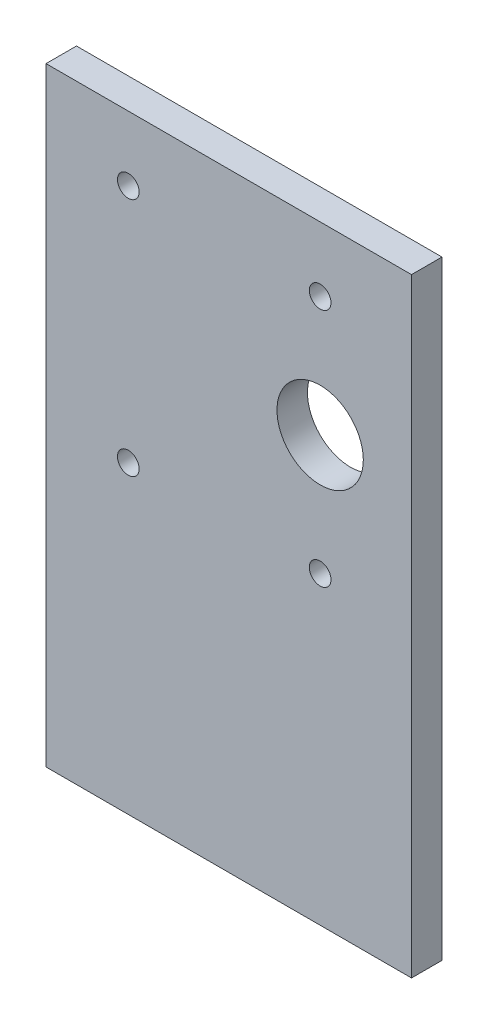
ISO-10303-21;
HEADER;
FILE_DESCRIPTION(('STEP AP214'),'2;1');
FILE_NAME('part.step','',(''),(''),'','','');
FILE_SCHEMA(('AUTOMOTIVE_DESIGN { 1 0 10303 214 1 1 1 1 }'));
ENDSEC;
DATA;
#1=APPLICATION_CONTEXT('core data for automotive mechanical design processes');
#2=APPLICATION_PROTOCOL_DEFINITION('international standard','automotive_design',2000,#1);
#3=PRODUCT_CONTEXT('',#1,'mechanical');
#4=PRODUCT('Part','Part','',(#3));
#5=PRODUCT_RELATED_PRODUCT_CATEGORY('part','',(#4));
#6=PRODUCT_DEFINITION_FORMATION('','',#4);
#7=PRODUCT_DEFINITION_CONTEXT('part definition',#1,'design');
#8=PRODUCT_DEFINITION('design','',#6,#7);
#9=PRODUCT_DEFINITION_SHAPE('','',#8);
#10=(LENGTH_UNIT() NAMED_UNIT(*) SI_UNIT(.MILLI.,.METRE.));
#11=(NAMED_UNIT(*) PLANE_ANGLE_UNIT() SI_UNIT($,.RADIAN.));
#12=(NAMED_UNIT(*) SI_UNIT($,.STERADIAN.) SOLID_ANGLE_UNIT());
#13=UNCERTAINTY_MEASURE_WITH_UNIT(LENGTH_MEASURE(1.E-05),#10,'distance_accuracy_value','');
#14=(GEOMETRIC_REPRESENTATION_CONTEXT(3) GLOBAL_UNCERTAINTY_ASSIGNED_CONTEXT((#13)) GLOBAL_UNIT_ASSIGNED_CONTEXT((#10,
#11,#12)) REPRESENTATION_CONTEXT('',''));
#15=CARTESIAN_POINT('',(0.,0.,0.));
#16=DIRECTION('',(0.,0.,1.));
#17=DIRECTION('',(1.,0.,0.));
#18=AXIS2_PLACEMENT_3D('',#15,#16,#17);
#19=CARTESIAN_POINT('',(-17.6716141001855,16.0811688311688,3.175));
#20=DIRECTION('',(1.,0.,0.));
#21=DIRECTION('',(0.,1.,0.));
#22=AXIS2_PLACEMENT_3D('',#19,#20,#21);
#23=PLANE('',#22);
#24=DIRECTION('',(0.,-1.,0.));
#25=VECTOR('',#24,1.);
#26=CARTESIAN_POINT('',(-17.6716141001855,16.0811688311688,0.));
#27=LINE('',#26,#25);
#28=CARTESIAN_POINT('',(-17.6716141001855,16.0811688311688,0.));
#29=VERTEX_POINT('',#28);
#30=CARTESIAN_POINT('',(-17.6716141001855,-47.4188311688312,0.));
#31=VERTEX_POINT('',#30);
#32=EDGE_CURVE('E100',#29,#31,#27,.T.);
#33=ORIENTED_EDGE('',*,*,#32,.T.);
#34=DIRECTION('',(0.,0.,-1.));
#35=VECTOR('',#34,1.);
#36=CARTESIAN_POINT('',(-17.6716141001855,-47.4188311688312,3.175));
#37=LINE('',#36,#35);
#38=CARTESIAN_POINT('',(-17.6716141001855,-47.4188311688312,3.175));
#39=VERTEX_POINT('',#38);
#40=EDGE_CURVE('E11',#39,#31,#37,.T.);
#41=ORIENTED_EDGE('',*,*,#40,.F.);
#42=DIRECTION('',(0.,-1.,0.));
#43=VECTOR('',#42,1.);
#44=CARTESIAN_POINT('',(-17.6716141001855,16.0811688311688,3.175));
#45=LINE('',#44,#43);
#46=CARTESIAN_POINT('',(-17.6716141001855,16.0811688311688,3.175));
#47=VERTEX_POINT('',#46);
#48=EDGE_CURVE('E88',#47,#39,#45,.T.);
#49=ORIENTED_EDGE('',*,*,#48,.F.);
#50=DIRECTION('',(0.,0.,-1.));
#51=VECTOR('',#50,1.);
#52=CARTESIAN_POINT('',(-17.6716141001855,16.0811688311688,3.175));
#53=LINE('',#52,#51);
#54=EDGE_CURVE('E96',#47,#29,#53,.T.);
#55=ORIENTED_EDGE('',*,*,#54,.T.);
#56=EDGE_LOOP('',(#33,#41,#49,#55));
#57=FACE_BOUND('',#56,.T.);
#58=ADVANCED_FACE('F37',(#57),#23,.F.);
#59=CARTESIAN_POINT('',(-17.6716141001855,-47.4188311688312,3.175));
#60=DIRECTION('',(0.,1.,0.));
#61=DIRECTION('',(0.,0.,1.));
#62=AXIS2_PLACEMENT_3D('',#59,#60,#61);
#63=PLANE('',#62);
#64=DIRECTION('',(1.,0.,0.));
#65=VECTOR('',#64,1.);
#66=CARTESIAN_POINT('',(-17.6716141001855,-47.4188311688312,0.));
#67=LINE('',#66,#65);
#68=CARTESIAN_POINT('',(20.4283858998145,-47.4188311688312,0.));
#69=VERTEX_POINT('',#68);
#70=EDGE_CURVE('E92',#31,#69,#67,.T.);
#71=ORIENTED_EDGE('',*,*,#70,.T.);
#72=DIRECTION('',(0.,0.,-1.));
#73=VECTOR('',#72,1.);
#74=CARTESIAN_POINT('',(20.4283858998145,-47.4188311688312,3.175));
#75=LINE('',#74,#73);
#76=CARTESIAN_POINT('',(20.4283858998145,-47.4188311688312,3.175));
#77=VERTEX_POINT('',#76);
#78=EDGE_CURVE('E45',#77,#69,#75,.T.);
#79=ORIENTED_EDGE('',*,*,#78,.F.);
#80=DIRECTION('',(1.,0.,0.));
#81=VECTOR('',#80,1.);
#82=CARTESIAN_POINT('',(-17.6716141001855,-47.4188311688312,3.175));
#83=LINE('',#82,#81);
#84=EDGE_CURVE('E83',#39,#77,#83,.T.);
#85=ORIENTED_EDGE('',*,*,#84,.F.);
#86=ORIENTED_EDGE('',*,*,#40,.T.);
#87=EDGE_LOOP('',(#71,#79,#85,#86));
#88=FACE_BOUND('',#87,.T.);
#89=ADVANCED_FACE('F91',(#88),#63,.F.);
#90=CARTESIAN_POINT('',(20.4283858998145,16.0811688311688,3.175));
#91=DIRECTION('',(-1.,0.,0.));
#92=DIRECTION('',(0.,-1.,0.));
#93=AXIS2_PLACEMENT_3D('',#90,#91,#92);
#94=PLANE('',#93);
#95=DIRECTION('',(0.,1.,0.));
#96=VECTOR('',#95,1.);
#97=CARTESIAN_POINT('',(20.4283858998145,16.0811688311688,0.));
#98=LINE('',#97,#96);
#99=CARTESIAN_POINT('',(20.4283858998145,16.0811688311688,0.));
#100=VERTEX_POINT('',#99);
#101=EDGE_CURVE('E70',#69,#100,#98,.T.);
#102=ORIENTED_EDGE('',*,*,#101,.T.);
#103=DIRECTION('',(0.,0.,-1.));
#104=VECTOR('',#103,1.);
#105=CARTESIAN_POINT('',(20.4283858998145,16.0811688311688,3.175));
#106=LINE('',#105,#104);
#107=CARTESIAN_POINT('',(20.4283858998145,16.0811688311688,3.175));
#108=VERTEX_POINT('',#107);
#109=EDGE_CURVE('E93',#108,#100,#106,.T.);
#110=ORIENTED_EDGE('',*,*,#109,.F.);
#111=DIRECTION('',(0.,1.,0.));
#112=VECTOR('',#111,1.);
#113=CARTESIAN_POINT('',(20.4283858998145,16.0811688311688,3.175));
#114=LINE('',#113,#112);
#115=EDGE_CURVE('E86',#77,#108,#114,.T.);
#116=ORIENTED_EDGE('',*,*,#115,.F.);
#117=ORIENTED_EDGE('',*,*,#78,.T.);
#118=EDGE_LOOP('',(#102,#110,#116,#117));
#119=FACE_BOUND('',#118,.T.);
#120=ADVANCED_FACE('F94',(#119),#94,.F.);
#121=CARTESIAN_POINT('',(-17.6716141001855,16.0811688311688,3.175));
#122=DIRECTION('',(0.,-1.,0.));
#123=DIRECTION('',(0.,0.,-1.));
#124=AXIS2_PLACEMENT_3D('',#121,#122,#123);
#125=PLANE('',#124);
#126=DIRECTION('',(-1.,0.,0.));
#127=VECTOR('',#126,1.);
#128=CARTESIAN_POINT('',(-17.6716141001855,16.0811688311688,0.));
#129=LINE('',#128,#127);
#130=EDGE_CURVE('E76',#100,#29,#129,.T.);
#131=ORIENTED_EDGE('',*,*,#130,.T.);
#132=ORIENTED_EDGE('',*,*,#54,.F.);
#133=DIRECTION('',(-1.,0.,0.));
#134=VECTOR('',#133,1.);
#135=CARTESIAN_POINT('',(-17.6716141001855,16.0811688311688,3.175));
#136=LINE('',#135,#134);
#137=EDGE_CURVE('E53',#108,#47,#136,.T.);
#138=ORIENTED_EDGE('',*,*,#137,.F.);
#139=ORIENTED_EDGE('',*,*,#109,.T.);
#140=EDGE_LOOP('',(#131,#132,#138,#139));
#141=FACE_BOUND('',#140,.T.);
#142=ADVANCED_FACE('F108',(#141),#125,.F.);
#143=CARTESIAN_POINT('',(0.,0.,3.175));
#144=DIRECTION('',(0.,0.,1.));
#145=DIRECTION('',(1.,0.,0.));
#146=AXIS2_PLACEMENT_3D('',#143,#144,#145);
#147=PLANE('',#146);
#148=CARTESIAN_POINT('',(10.9033858998145,-3.16395549842647,3.175));
#149=DIRECTION('',(0.,0.,1.));
#150=DIRECTION('',(1.,0.,0.));
#151=AXIS2_PLACEMENT_3D('',#148,#149,#150);
#152=CIRCLE('',#151,4.5);
#153=CARTESIAN_POINT('',(15.4033858998145,-3.16395549842647,3.175));
#154=VERTEX_POINT('',#153);
#155=EDGE_CURVE('E138',#154,#154,#152,.T.);
#156=ORIENTED_EDGE('',*,*,#155,.F.);
#157=EDGE_LOOP('',(#156));
#158=FACE_BOUND('',#157,.T.);
#159=CARTESIAN_POINT('',(10.9033858998145,9.33604450157353,3.175));
#160=DIRECTION('',(0.,0.,1.));
#161=DIRECTION('',(1.,0.,0.));
#162=AXIS2_PLACEMENT_3D('',#159,#160,#161);
#163=CIRCLE('',#162,1.13029999999999);
#164=CARTESIAN_POINT('',(12.0336858998145,9.33604450157353,3.175));
#165=VERTEX_POINT('',#164);
#166=EDGE_CURVE('E134',#165,#165,#163,.T.);
#167=ORIENTED_EDGE('',*,*,#166,.F.);
#168=EDGE_LOOP('',(#167));
#169=FACE_BOUND('',#168,.T.);
#170=CARTESIAN_POINT('',(10.9033858998145,-15.6639554984265,3.175));
#171=DIRECTION('',(0.,0.,1.));
#172=DIRECTION('',(1.,0.,0.));
#173=AXIS2_PLACEMENT_3D('',#170,#171,#172);
#174=CIRCLE('',#173,1.13029999999999);
#175=CARTESIAN_POINT('',(12.0336858998145,-15.6639554984265,3.175));
#176=VERTEX_POINT('',#175);
#177=EDGE_CURVE('E128',#176,#176,#174,.T.);
#178=ORIENTED_EDGE('',*,*,#177,.F.);
#179=EDGE_LOOP('',(#178));
#180=FACE_BOUND('',#179,.T.);
#181=CARTESIAN_POINT('',(-9.09661410018551,-15.6639554984265,3.175));
#182=DIRECTION('',(0.,0.,1.));
#183=DIRECTION('',(1.,0.,0.));
#184=AXIS2_PLACEMENT_3D('',#181,#182,#183);
#185=CIRCLE('',#184,1.13029999999999);
#186=CARTESIAN_POINT('',(-7.96631410018553,-15.6639554984265,3.175));
#187=VERTEX_POINT('',#186);
#188=EDGE_CURVE('E122',#187,#187,#185,.T.);
#189=ORIENTED_EDGE('',*,*,#188,.F.);
#190=EDGE_LOOP('',(#189));
#191=FACE_BOUND('',#190,.T.);
#192=CARTESIAN_POINT('',(-9.09661410018552,9.33604450157353,3.175));
#193=DIRECTION('',(0.,0.,1.));
#194=DIRECTION('',(1.,0.,0.));
#195=AXIS2_PLACEMENT_3D('',#192,#193,#194);
#196=CIRCLE('',#195,1.13029999999999);
#197=CARTESIAN_POINT('',(-7.96631410018553,9.33604450157353,3.175));
#198=VERTEX_POINT('',#197);
#199=EDGE_CURVE('E116',#198,#198,#196,.T.);
#200=ORIENTED_EDGE('',*,*,#199,.F.);
#201=EDGE_LOOP('',(#200));
#202=FACE_BOUND('',#201,.T.);
#203=ORIENTED_EDGE('',*,*,#48,.T.);
#204=ORIENTED_EDGE('',*,*,#84,.T.);
#205=ORIENTED_EDGE('',*,*,#115,.T.);
#206=ORIENTED_EDGE('',*,*,#137,.T.);
#207=EDGE_LOOP('',(#203,#204,#205,#206));
#208=FACE_BOUND('',#207,.T.);
#209=ADVANCED_FACE('F84',(#158,#169,#180,#191,#202,#208),#147,.T.);
#210=CARTESIAN_POINT('',(0.,0.,0.));
#211=DIRECTION('',(0.,0.,1.));
#212=DIRECTION('',(1.,0.,0.));
#213=AXIS2_PLACEMENT_3D('',#210,#211,#212);
#214=PLANE('',#213);
#215=CARTESIAN_POINT('',(10.9033858998145,-3.16395549842647,0.));
#216=DIRECTION('',(0.,0.,1.));
#217=DIRECTION('',(1.,0.,0.));
#218=AXIS2_PLACEMENT_3D('',#215,#216,#217);
#219=CIRCLE('',#218,4.5);
#220=CARTESIAN_POINT('',(15.4033858998145,-3.16395549842647,0.));
#221=VERTEX_POINT('',#220);
#222=EDGE_CURVE('E137',#221,#221,#219,.T.);
#223=ORIENTED_EDGE('',*,*,#222,.T.);
#224=EDGE_LOOP('',(#223));
#225=FACE_BOUND('',#224,.T.);
#226=CARTESIAN_POINT('',(10.9033858998145,9.33604450157353,0.));
#227=DIRECTION('',(0.,0.,1.));
#228=DIRECTION('',(1.,0.,0.));
#229=AXIS2_PLACEMENT_3D('',#226,#227,#228);
#230=CIRCLE('',#229,1.1303);
#231=CARTESIAN_POINT('',(12.0336858998145,9.33604450157353,0.));
#232=VERTEX_POINT('',#231);
#233=EDGE_CURVE('E131',#232,#232,#230,.T.);
#234=ORIENTED_EDGE('',*,*,#233,.T.);
#235=EDGE_LOOP('',(#234));
#236=FACE_BOUND('',#235,.T.);
#237=CARTESIAN_POINT('',(10.9033858998145,-15.6639554984265,0.));
#238=DIRECTION('',(0.,0.,1.));
#239=DIRECTION('',(1.,0.,0.));
#240=AXIS2_PLACEMENT_3D('',#237,#238,#239);
#241=CIRCLE('',#240,1.1303);
#242=CARTESIAN_POINT('',(12.0336858998145,-15.6639554984265,0.));
#243=VERTEX_POINT('',#242);
#244=EDGE_CURVE('E125',#243,#243,#241,.T.);
#245=ORIENTED_EDGE('',*,*,#244,.T.);
#246=EDGE_LOOP('',(#245));
#247=FACE_BOUND('',#246,.T.);
#248=CARTESIAN_POINT('',(-9.09661410018551,-15.6639554984265,0.));
#249=DIRECTION('',(0.,0.,1.));
#250=DIRECTION('',(1.,0.,0.));
#251=AXIS2_PLACEMENT_3D('',#248,#249,#250);
#252=CIRCLE('',#251,1.1303);
#253=CARTESIAN_POINT('',(-7.96631410018551,-15.6639554984265,0.));
#254=VERTEX_POINT('',#253);
#255=EDGE_CURVE('E119',#254,#254,#252,.T.);
#256=ORIENTED_EDGE('',*,*,#255,.T.);
#257=EDGE_LOOP('',(#256));
#258=FACE_BOUND('',#257,.T.);
#259=CARTESIAN_POINT('',(-9.09661410018552,9.33604450157353,0.));
#260=DIRECTION('',(0.,0.,1.));
#261=DIRECTION('',(1.,0.,0.));
#262=AXIS2_PLACEMENT_3D('',#259,#260,#261);
#263=CIRCLE('',#262,1.1303);
#264=CARTESIAN_POINT('',(-7.96631410018552,9.33604450157353,0.));
#265=VERTEX_POINT('',#264);
#266=EDGE_CURVE('E103',#265,#265,#263,.T.);
#267=ORIENTED_EDGE('',*,*,#266,.T.);
#268=EDGE_LOOP('',(#267));
#269=FACE_BOUND('',#268,.T.);
#270=ORIENTED_EDGE('',*,*,#32,.F.);
#271=ORIENTED_EDGE('',*,*,#130,.F.);
#272=ORIENTED_EDGE('',*,*,#101,.F.);
#273=ORIENTED_EDGE('',*,*,#70,.F.);
#274=EDGE_LOOP('',(#270,#271,#272,#273));
#275=FACE_BOUND('',#274,.T.);
#276=ADVANCED_FACE('F111',(#225,#236,#247,#258,#269,#275),#214,.F.);
#277=CARTESIAN_POINT('',(-9.09661410018552,9.33604450157353,3.175));
#278=DIRECTION('',(0.,0.,1.));
#279=DIRECTION('',(1.,0.,0.));
#280=AXIS2_PLACEMENT_3D('',#277,#278,#279);
#281=CYLINDRICAL_SURFACE('',#280,1.13029999999999);
#282=ORIENTED_EDGE('',*,*,#266,.F.);
#283=EDGE_LOOP('',(#282));
#284=FACE_BOUND('',#283,.T.);
#285=ORIENTED_EDGE('',*,*,#199,.T.);
#286=EDGE_LOOP('',(#285));
#287=FACE_BOUND('',#286,.T.);
#288=ADVANCED_FACE('F164',(#284,#287),#281,.F.);
#289=CARTESIAN_POINT('',(-9.09661410018551,-15.6639554984265,3.175));
#290=DIRECTION('',(0.,0.,1.));
#291=DIRECTION('',(1.,0.,0.));
#292=AXIS2_PLACEMENT_3D('',#289,#290,#291);
#293=CYLINDRICAL_SURFACE('',#292,1.13029999999999);
#294=ORIENTED_EDGE('',*,*,#255,.F.);
#295=EDGE_LOOP('',(#294));
#296=FACE_BOUND('',#295,.T.);
#297=ORIENTED_EDGE('',*,*,#188,.T.);
#298=EDGE_LOOP('',(#297));
#299=FACE_BOUND('',#298,.T.);
#300=ADVANCED_FACE('F166',(#296,#299),#293,.F.);
#301=CARTESIAN_POINT('',(10.9033858998145,-15.6639554984265,3.175));
#302=DIRECTION('',(0.,0.,1.));
#303=DIRECTION('',(1.,0.,0.));
#304=AXIS2_PLACEMENT_3D('',#301,#302,#303);
#305=CYLINDRICAL_SURFACE('',#304,1.13029999999999);
#306=ORIENTED_EDGE('',*,*,#244,.F.);
#307=EDGE_LOOP('',(#306));
#308=FACE_BOUND('',#307,.T.);
#309=ORIENTED_EDGE('',*,*,#177,.T.);
#310=EDGE_LOOP('',(#309));
#311=FACE_BOUND('',#310,.T.);
#312=ADVANCED_FACE('F173',(#308,#311),#305,.F.);
#313=CARTESIAN_POINT('',(10.9033858998145,9.33604450157353,3.175));
#314=DIRECTION('',(0.,0.,1.));
#315=DIRECTION('',(1.,0.,0.));
#316=AXIS2_PLACEMENT_3D('',#313,#314,#315);
#317=CYLINDRICAL_SURFACE('',#316,1.13029999999999);
#318=ORIENTED_EDGE('',*,*,#233,.F.);
#319=EDGE_LOOP('',(#318));
#320=FACE_BOUND('',#319,.T.);
#321=ORIENTED_EDGE('',*,*,#166,.T.);
#322=EDGE_LOOP('',(#321));
#323=FACE_BOUND('',#322,.T.);
#324=ADVANCED_FACE('F149',(#320,#323),#317,.F.);
#325=CARTESIAN_POINT('',(10.9033858998145,-3.16395549842647,0.));
#326=DIRECTION('',(0.,0.,1.));
#327=DIRECTION('',(1.,0.,0.));
#328=AXIS2_PLACEMENT_3D('',#325,#326,#327);
#329=CYLINDRICAL_SURFACE('',#328,4.5);
#330=ORIENTED_EDGE('',*,*,#222,.F.);
#331=EDGE_LOOP('',(#330));
#332=FACE_BOUND('',#331,.T.);
#333=ORIENTED_EDGE('',*,*,#155,.T.);
#334=EDGE_LOOP('',(#333));
#335=FACE_BOUND('',#334,.T.);
#336=ADVANCED_FACE('F146',(#332,#335),#329,.F.);
#337=CLOSED_SHELL('',(#58,#89,#120,#142,#209,#276,#288,#300,#312,#324,#336));
#338=MANIFOLD_SOLID_BREP('B2',#337);
#339=ADVANCED_BREP_SHAPE_REPRESENTATION('',(#18,#338),#14);
#340=SHAPE_DEFINITION_REPRESENTATION(#9,#339);
ENDSEC;
END-ISO-10303-21;
